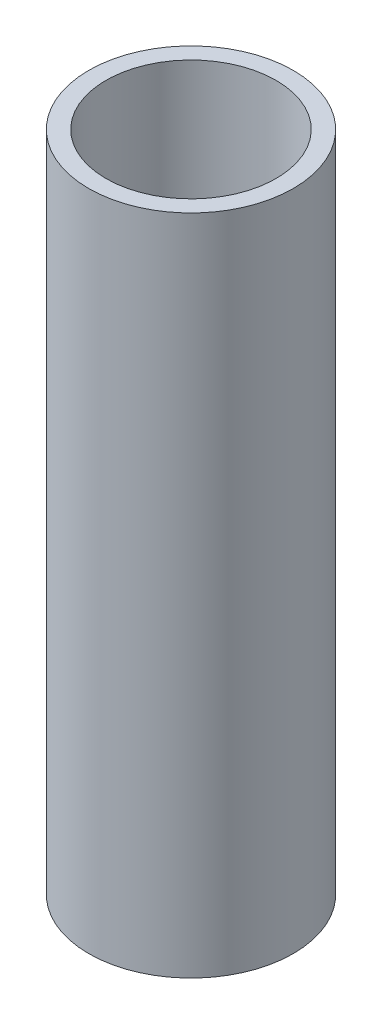
ISO-10303-21;
HEADER;
FILE_DESCRIPTION(('STEP AP214'),'2;1');
FILE_NAME('part.step','',(''),(''),'','','');
FILE_SCHEMA(('AUTOMOTIVE_DESIGN { 1 0 10303 214 1 1 1 1 }'));
ENDSEC;
DATA;
#1=APPLICATION_CONTEXT('core data for automotive mechanical design processes');
#2=APPLICATION_PROTOCOL_DEFINITION('international standard','automotive_design',2000,#1);
#3=PRODUCT_CONTEXT('',#1,'mechanical');
#4=PRODUCT('Part','Part','',(#3));
#5=PRODUCT_RELATED_PRODUCT_CATEGORY('part','',(#4));
#6=PRODUCT_DEFINITION_FORMATION('','',#4);
#7=PRODUCT_DEFINITION_CONTEXT('part definition',#1,'design');
#8=PRODUCT_DEFINITION('design','',#6,#7);
#9=PRODUCT_DEFINITION_SHAPE('','',#8);
#10=(LENGTH_UNIT() NAMED_UNIT(*) SI_UNIT(.MILLI.,.METRE.));
#11=(NAMED_UNIT(*) PLANE_ANGLE_UNIT() SI_UNIT($,.RADIAN.));
#12=(NAMED_UNIT(*) SI_UNIT($,.STERADIAN.) SOLID_ANGLE_UNIT());
#13=UNCERTAINTY_MEASURE_WITH_UNIT(LENGTH_MEASURE(1.E-05),#10,'distance_accuracy_value','');
#14=(GEOMETRIC_REPRESENTATION_CONTEXT(3) GLOBAL_UNCERTAINTY_ASSIGNED_CONTEXT((#13)) GLOBAL_UNIT_ASSIGNED_CONTEXT((#10,
#11,#12)) REPRESENTATION_CONTEXT('',''));
#15=CARTESIAN_POINT('',(0.,0.,0.));
#16=DIRECTION('',(0.,0.,1.));
#17=DIRECTION('',(1.,0.,0.));
#18=AXIS2_PLACEMENT_3D('',#15,#16,#17);
#19=CARTESIAN_POINT('',(0.,136.525,0.));
#20=DIRECTION('',(0.,1.,0.));
#21=DIRECTION('',(0.,0.,1.));
#22=AXIS2_PLACEMENT_3D('',#19,#20,#21);
#23=PLANE('',#22);
#24=CARTESIAN_POINT('',(0.,136.525,0.));
#25=DIRECTION('',(0.,1.,0.));
#26=DIRECTION('',(0.,0.,1.));
#27=AXIS2_PLACEMENT_3D('',#24,#25,#26);
#28=CIRCLE('',#27,21.082);
#29=CARTESIAN_POINT('',(0.,136.525,21.082));
#30=VERTEX_POINT('',#29);
#31=EDGE_CURVE('E10',#30,#30,#28,.T.);
#32=ORIENTED_EDGE('',*,*,#31,.T.);
#33=EDGE_LOOP('',(#32));
#34=FACE_BOUND('',#33,.T.);
#35=CARTESIAN_POINT('',(0.,136.525,0.));
#36=DIRECTION('',(0.,1.,0.));
#37=DIRECTION('',(0.,0.,1.));
#38=AXIS2_PLACEMENT_3D('',#35,#36,#37);
#39=CIRCLE('',#38,17.526);
#40=CARTESIAN_POINT('',(0.,136.525,17.526));
#41=VERTEX_POINT('',#40);
#42=EDGE_CURVE('E42',#41,#41,#39,.T.);
#43=ORIENTED_EDGE('',*,*,#42,.F.);
#44=EDGE_LOOP('',(#43));
#45=FACE_BOUND('',#44,.T.);
#46=ADVANCED_FACE('F30',(#34,#45),#23,.T.);
#47=CARTESIAN_POINT('',(0.,0.,0.));
#48=DIRECTION('',(0.,1.,0.));
#49=DIRECTION('',(0.,0.,1.));
#50=AXIS2_PLACEMENT_3D('',#47,#48,#49);
#51=PLANE('',#50);
#52=CARTESIAN_POINT('',(0.,0.,0.));
#53=DIRECTION('',(0.,1.,0.));
#54=DIRECTION('',(0.,0.,1.));
#55=AXIS2_PLACEMENT_3D('',#52,#53,#54);
#56=CIRCLE('',#55,21.082);
#57=CARTESIAN_POINT('',(0.,0.,21.082));
#58=VERTEX_POINT('',#57);
#59=EDGE_CURVE('E34',#58,#58,#56,.T.);
#60=ORIENTED_EDGE('',*,*,#59,.F.);
#61=EDGE_LOOP('',(#60));
#62=FACE_BOUND('',#61,.T.);
#63=CARTESIAN_POINT('',(0.,0.,0.));
#64=DIRECTION('',(0.,1.,0.));
#65=DIRECTION('',(0.,0.,1.));
#66=AXIS2_PLACEMENT_3D('',#63,#64,#65);
#67=CIRCLE('',#66,17.526);
#68=CARTESIAN_POINT('',(0.,0.,17.526));
#69=VERTEX_POINT('',#68);
#70=EDGE_CURVE('E44',#69,#69,#67,.T.);
#71=ORIENTED_EDGE('',*,*,#70,.T.);
#72=EDGE_LOOP('',(#71));
#73=FACE_BOUND('',#72,.T.);
#74=ADVANCED_FACE('F55',(#62,#73),#51,.F.);
#75=CARTESIAN_POINT('',(0.,136.525,0.));
#76=DIRECTION('',(0.,-1.,0.));
#77=DIRECTION('',(0.,0.,-1.));
#78=AXIS2_PLACEMENT_3D('',#75,#76,#77);
#79=CYLINDRICAL_SURFACE('',#78,21.082);
#80=ORIENTED_EDGE('',*,*,#31,.F.);
#81=EDGE_LOOP('',(#80));
#82=FACE_BOUND('',#81,.T.);
#83=ORIENTED_EDGE('',*,*,#59,.T.);
#84=EDGE_LOOP('',(#83));
#85=FACE_BOUND('',#84,.T.);
#86=ADVANCED_FACE('F32',(#82,#85),#79,.T.);
#87=CARTESIAN_POINT('',(0.,136.525,0.));
#88=DIRECTION('',(0.,-1.,0.));
#89=DIRECTION('',(0.,0.,-1.));
#90=AXIS2_PLACEMENT_3D('',#87,#88,#89);
#91=CYLINDRICAL_SURFACE('',#90,17.526);
#92=ORIENTED_EDGE('',*,*,#42,.T.);
#93=EDGE_LOOP('',(#92));
#94=FACE_BOUND('',#93,.T.);
#95=ORIENTED_EDGE('',*,*,#70,.F.);
#96=EDGE_LOOP('',(#95));
#97=FACE_BOUND('',#96,.T.);
#98=ADVANCED_FACE('F51',(#94,#97),#91,.F.);
#99=CLOSED_SHELL('',(#46,#74,#86,#98));
#100=MANIFOLD_SOLID_BREP('B2',#99);
#101=ADVANCED_BREP_SHAPE_REPRESENTATION('',(#18,#100),#14);
#102=SHAPE_DEFINITION_REPRESENTATION(#9,#101);
ENDSEC;
END-ISO-10303-21;
